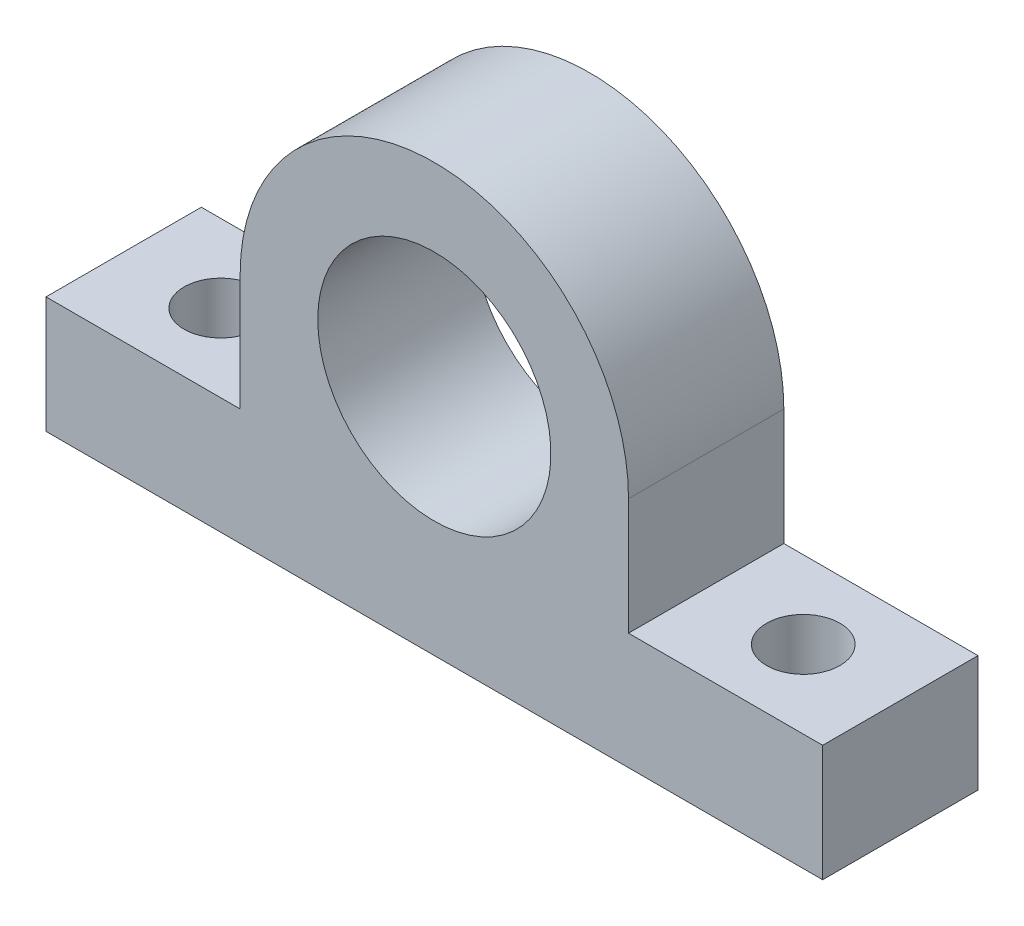
ISO-10303-21;
HEADER;
FILE_DESCRIPTION(('STEP AP214'),'2;1');
FILE_NAME('part.step','',(''),(''),'','','');
FILE_SCHEMA(('AUTOMOTIVE_DESIGN { 1 0 10303 214 1 1 1 1 }'));
ENDSEC;
DATA;
#1=APPLICATION_CONTEXT('core data for automotive mechanical design processes');
#2=APPLICATION_PROTOCOL_DEFINITION('international standard','automotive_design',2000,#1);
#3=PRODUCT_CONTEXT('',#1,'mechanical');
#4=PRODUCT('Part','Part','',(#3));
#5=PRODUCT_RELATED_PRODUCT_CATEGORY('part','',(#4));
#6=PRODUCT_DEFINITION_FORMATION('','',#4);
#7=PRODUCT_DEFINITION_CONTEXT('part definition',#1,'design');
#8=PRODUCT_DEFINITION('design','',#6,#7);
#9=PRODUCT_DEFINITION_SHAPE('','',#8);
#10=(LENGTH_UNIT() NAMED_UNIT(*) SI_UNIT(.MILLI.,.METRE.));
#11=(NAMED_UNIT(*) PLANE_ANGLE_UNIT() SI_UNIT($,.RADIAN.));
#12=(NAMED_UNIT(*) SI_UNIT($,.STERADIAN.) SOLID_ANGLE_UNIT());
#13=UNCERTAINTY_MEASURE_WITH_UNIT(LENGTH_MEASURE(1.E-05),#10,'distance_accuracy_value','');
#14=(GEOMETRIC_REPRESENTATION_CONTEXT(3) GLOBAL_UNCERTAINTY_ASSIGNED_CONTEXT((#13)) GLOBAL_UNIT_ASSIGNED_CONTEXT((#10,
#11,#12)) REPRESENTATION_CONTEXT('',''));
#15=CARTESIAN_POINT('',(0.,0.,0.));
#16=DIRECTION('',(0.,0.,1.));
#17=DIRECTION('',(1.,0.,0.));
#18=AXIS2_PLACEMENT_3D('',#15,#16,#17);
#19=CARTESIAN_POINT('',(0.,28.575,25.4));
#20=DIRECTION('',(0.,0.,-1.));
#21=DIRECTION('',(-1.,0.,0.));
#22=AXIS2_PLACEMENT_3D('',#19,#20,#21);
#23=CYLINDRICAL_SURFACE('',#22,31.75);
#24=CARTESIAN_POINT('',(0.,28.575,0.));
#25=DIRECTION('',(0.,0.,1.));
#26=DIRECTION('',(1.,0.,0.));
#27=AXIS2_PLACEMENT_3D('',#24,#25,#26);
#28=CIRCLE('',#27,31.75);
#29=CARTESIAN_POINT('',(-31.75,28.575,0.));
#30=VERTEX_POINT('',#29);
#31=CARTESIAN_POINT('',(31.75,28.575,0.));
#32=VERTEX_POINT('',#31);
#33=EDGE_CURVE('E152',#30,#32,#28,.F.);
#34=ORIENTED_EDGE('',*,*,#33,.F.);
#35=DIRECTION('',(0.,0.,-1.));
#36=VECTOR('',#35,1.);
#37=CARTESIAN_POINT('',(-31.75,28.575,25.4));
#38=LINE('',#37,#36);
#39=CARTESIAN_POINT('',(-31.75,28.575,25.4));
#40=VERTEX_POINT('',#39);
#41=EDGE_CURVE('E11',#40,#30,#38,.T.);
#42=ORIENTED_EDGE('',*,*,#41,.F.);
#43=CARTESIAN_POINT('',(0.,28.575,25.4));
#44=DIRECTION('',(0.,0.,1.));
#45=DIRECTION('',(1.,0.,0.));
#46=AXIS2_PLACEMENT_3D('',#43,#44,#45);
#47=CIRCLE('',#46,31.75);
#48=CARTESIAN_POINT('',(31.75,28.575,25.4));
#49=VERTEX_POINT('',#48);
#50=EDGE_CURVE('E139',#40,#49,#47,.F.);
#51=ORIENTED_EDGE('',*,*,#50,.T.);
#52=DIRECTION('',(0.,0.,-1.));
#53=VECTOR('',#52,1.);
#54=CARTESIAN_POINT('',(31.75,28.575,25.4));
#55=LINE('',#54,#53);
#56=EDGE_CURVE('E87',#49,#32,#55,.T.);
#57=ORIENTED_EDGE('',*,*,#56,.T.);
#58=EDGE_LOOP('',(#34,#42,#51,#57));
#59=FACE_BOUND('',#58,.T.);
#60=ADVANCED_FACE('F37',(#59),#23,.T.);
#61=CARTESIAN_POINT('',(-31.75,0.,25.4));
#62=DIRECTION('',(-1.,0.,0.));
#63=DIRECTION('',(0.,-1.,0.));
#64=AXIS2_PLACEMENT_3D('',#61,#62,#63);
#65=PLANE('',#64);
#66=DIRECTION('',(0.,1.,0.));
#67=VECTOR('',#66,1.);
#68=CARTESIAN_POINT('',(-31.75,0.,0.));
#69=LINE('',#68,#67);
#70=CARTESIAN_POINT('',(-31.75,9.525,0.));
#71=VERTEX_POINT('',#70);
#72=EDGE_CURVE('E181',#71,#30,#69,.T.);
#73=ORIENTED_EDGE('',*,*,#72,.F.);
#74=DIRECTION('',(0.,0.,-1.));
#75=VECTOR('',#74,1.);
#76=CARTESIAN_POINT('',(-31.75,9.525,25.4));
#77=LINE('',#76,#75);
#78=CARTESIAN_POINT('',(-31.75,9.525,25.4));
#79=VERTEX_POINT('',#78);
#80=EDGE_CURVE('E45',#79,#71,#77,.T.);
#81=ORIENTED_EDGE('',*,*,#80,.F.);
#82=DIRECTION('',(0.,1.,0.));
#83=VECTOR('',#82,1.);
#84=CARTESIAN_POINT('',(-31.75,0.,25.4));
#85=LINE('',#84,#83);
#86=EDGE_CURVE('E134',#79,#40,#85,.T.);
#87=ORIENTED_EDGE('',*,*,#86,.T.);
#88=ORIENTED_EDGE('',*,*,#41,.T.);
#89=EDGE_LOOP('',(#73,#81,#87,#88));
#90=FACE_BOUND('',#89,.T.);
#91=ADVANCED_FACE('F170',(#90),#65,.T.);
#92=CARTESIAN_POINT('',(0.,9.525,25.4));
#93=DIRECTION('',(0.,1.,0.));
#94=DIRECTION('',(0.,0.,1.));
#95=AXIS2_PLACEMENT_3D('',#92,#93,#94);
#96=PLANE('',#95);
#97=CARTESIAN_POINT('',(-47.625,9.525,12.7));
#98=DIRECTION('',(0.,1.,0.));
#99=DIRECTION('',(0.,0.,1.));
#100=AXIS2_PLACEMENT_3D('',#97,#98,#99);
#101=CIRCLE('',#100,6.);
#102=CARTESIAN_POINT('',(-47.625,9.525,18.7));
#103=VERTEX_POINT('',#102);
#104=EDGE_CURVE('E161',#103,#103,#101,.T.);
#105=ORIENTED_EDGE('',*,*,#104,.F.);
#106=EDGE_LOOP('',(#105));
#107=FACE_BOUND('',#106,.T.);
#108=DIRECTION('',(1.,0.,0.));
#109=VECTOR('',#108,1.);
#110=CARTESIAN_POINT('',(0.,9.525,0.));
#111=LINE('',#110,#109);
#112=CARTESIAN_POINT('',(-63.5,9.525,0.));
#113=VERTEX_POINT('',#112);
#114=EDGE_CURVE('E174',#113,#71,#111,.T.);
#115=ORIENTED_EDGE('',*,*,#114,.F.);
#116=DIRECTION('',(0.,0.,-1.));
#117=VECTOR('',#116,1.);
#118=CARTESIAN_POINT('',(-63.5,9.525,25.4));
#119=LINE('',#118,#117);
#120=CARTESIAN_POINT('',(-63.5,9.525,25.4));
#121=VERTEX_POINT('',#120);
#122=EDGE_CURVE('E176',#121,#113,#119,.T.);
#123=ORIENTED_EDGE('',*,*,#122,.F.);
#124=DIRECTION('',(1.,0.,0.));
#125=VECTOR('',#124,1.);
#126=CARTESIAN_POINT('',(0.,9.525,25.4));
#127=LINE('',#126,#125);
#128=EDGE_CURVE('E128',#121,#79,#127,.T.);
#129=ORIENTED_EDGE('',*,*,#128,.T.);
#130=ORIENTED_EDGE('',*,*,#80,.T.);
#131=EDGE_LOOP('',(#115,#123,#129,#130));
#132=FACE_BOUND('',#131,.T.);
#133=ADVANCED_FACE('F167',(#107,#132),#96,.T.);
#134=CARTESIAN_POINT('',(-63.5,0.,25.4));
#135=DIRECTION('',(-1.,0.,0.));
#136=DIRECTION('',(0.,0.,1.));
#137=AXIS2_PLACEMENT_3D('',#134,#135,#136);
#138=PLANE('',#137);
#139=DIRECTION('',(0.,1.,0.));
#140=VECTOR('',#139,1.);
#141=CARTESIAN_POINT('',(-63.5,0.,0.));
#142=LINE('',#141,#140);
#143=CARTESIAN_POINT('',(-63.5,-9.525,0.));
#144=VERTEX_POINT('',#143);
#145=EDGE_CURVE('E180',#144,#113,#142,.T.);
#146=ORIENTED_EDGE('',*,*,#145,.F.);
#147=DIRECTION('',(0.,0.,-1.));
#148=VECTOR('',#147,1.);
#149=CARTESIAN_POINT('',(-63.5,-9.525,25.4));
#150=LINE('',#149,#148);
#151=CARTESIAN_POINT('',(-63.5,-9.525,25.4));
#152=VERTEX_POINT('',#151);
#153=EDGE_CURVE('E199',#152,#144,#150,.T.);
#154=ORIENTED_EDGE('',*,*,#153,.F.);
#155=DIRECTION('',(0.,1.,0.));
#156=VECTOR('',#155,1.);
#157=CARTESIAN_POINT('',(-63.5,0.,25.4));
#158=LINE('',#157,#156);
#159=EDGE_CURVE('E133',#152,#121,#158,.T.);
#160=ORIENTED_EDGE('',*,*,#159,.T.);
#161=ORIENTED_EDGE('',*,*,#122,.T.);
#162=EDGE_LOOP('',(#146,#154,#160,#161));
#163=FACE_BOUND('',#162,.T.);
#164=ADVANCED_FACE('F169',(#163),#138,.T.);
#165=CARTESIAN_POINT('',(0.,-9.525,25.4));
#166=DIRECTION('',(0.,1.,0.));
#167=DIRECTION('',(0.,0.,1.));
#168=AXIS2_PLACEMENT_3D('',#165,#166,#167);
#169=PLANE('',#168);
#170=CARTESIAN_POINT('',(-47.625,-9.525,12.7));
#171=DIRECTION('',(0.,1.,0.));
#172=DIRECTION('',(0.,0.,1.));
#173=AXIS2_PLACEMENT_3D('',#170,#171,#172);
#174=CIRCLE('',#173,6.);
#175=CARTESIAN_POINT('',(-47.625,-9.525,18.7));
#176=VERTEX_POINT('',#175);
#177=EDGE_CURVE('E158',#176,#176,#174,.T.);
#178=ORIENTED_EDGE('',*,*,#177,.T.);
#179=EDGE_LOOP('',(#178));
#180=FACE_BOUND('',#179,.T.);
#181=CARTESIAN_POINT('',(47.625,-9.525,12.7));
#182=DIRECTION('',(0.,1.,0.));
#183=DIRECTION('',(0.,0.,1.));
#184=AXIS2_PLACEMENT_3D('',#181,#182,#183);
#185=CIRCLE('',#184,6.);
#186=CARTESIAN_POINT('',(47.625,-9.525,18.7));
#187=VERTEX_POINT('',#186);
#188=EDGE_CURVE('E149',#187,#187,#185,.T.);
#189=ORIENTED_EDGE('',*,*,#188,.T.);
#190=EDGE_LOOP('',(#189));
#191=FACE_BOUND('',#190,.T.);
#192=DIRECTION('',(1.,0.,0.));
#193=VECTOR('',#192,1.);
#194=CARTESIAN_POINT('',(0.,-9.525,0.));
#195=LINE('',#194,#193);
#196=CARTESIAN_POINT('',(63.5,-9.525,0.));
#197=VERTEX_POINT('',#196);
#198=EDGE_CURVE('E188',#144,#197,#195,.T.);
#199=ORIENTED_EDGE('',*,*,#198,.T.);
#200=DIRECTION('',(0.,0.,-1.));
#201=VECTOR('',#200,1.);
#202=CARTESIAN_POINT('',(63.5,-9.525,25.4));
#203=LINE('',#202,#201);
#204=CARTESIAN_POINT('',(63.5,-9.525,25.4));
#205=VERTEX_POINT('',#204);
#206=EDGE_CURVE('E124',#205,#197,#203,.T.);
#207=ORIENTED_EDGE('',*,*,#206,.F.);
#208=DIRECTION('',(1.,0.,0.));
#209=VECTOR('',#208,1.);
#210=CARTESIAN_POINT('',(0.,-9.525,25.4));
#211=LINE('',#210,#209);
#212=EDGE_CURVE('E111',#152,#205,#211,.T.);
#213=ORIENTED_EDGE('',*,*,#212,.F.);
#214=ORIENTED_EDGE('',*,*,#153,.T.);
#215=EDGE_LOOP('',(#199,#207,#213,#214));
#216=FACE_BOUND('',#215,.T.);
#217=ADVANCED_FACE('F210',(#180,#191,#216),#169,.F.);
#218=CARTESIAN_POINT('',(63.5,0.,25.4));
#219=DIRECTION('',(-1.,0.,0.));
#220=DIRECTION('',(0.,0.,1.));
#221=AXIS2_PLACEMENT_3D('',#218,#219,#220);
#222=PLANE('',#221);
#223=DIRECTION('',(0.,1.,0.));
#224=VECTOR('',#223,1.);
#225=CARTESIAN_POINT('',(63.5,0.,0.));
#226=LINE('',#225,#224);
#227=CARTESIAN_POINT('',(63.5,9.525,0.));
#228=VERTEX_POINT('',#227);
#229=EDGE_CURVE('E120',#197,#228,#226,.T.);
#230=ORIENTED_EDGE('',*,*,#229,.T.);
#231=DIRECTION('',(0.,0.,-1.));
#232=VECTOR('',#231,1.);
#233=CARTESIAN_POINT('',(63.5,9.525,25.4));
#234=LINE('',#233,#232);
#235=CARTESIAN_POINT('',(63.5,9.525,25.4));
#236=VERTEX_POINT('',#235);
#237=EDGE_CURVE('E117',#236,#228,#234,.T.);
#238=ORIENTED_EDGE('',*,*,#237,.F.);
#239=DIRECTION('',(0.,1.,0.));
#240=VECTOR('',#239,1.);
#241=CARTESIAN_POINT('',(63.5,0.,25.4));
#242=LINE('',#241,#240);
#243=EDGE_CURVE('E104',#205,#236,#242,.T.);
#244=ORIENTED_EDGE('',*,*,#243,.F.);
#245=ORIENTED_EDGE('',*,*,#206,.T.);
#246=EDGE_LOOP('',(#230,#238,#244,#245));
#247=FACE_BOUND('',#246,.T.);
#248=ADVANCED_FACE('F118',(#247),#222,.F.);
#249=CARTESIAN_POINT('',(47.625,9.525,12.7));
#250=DIRECTION('',(0.,1.,0.));
#251=DIRECTION('',(0.,0.,1.));
#252=AXIS2_PLACEMENT_3D('',#249,#250,#251);
#253=CIRCLE('',#252,6.);
#254=CARTESIAN_POINT('',(47.625,9.525,18.7));
#255=VERTEX_POINT('',#254);
#256=EDGE_CURVE('E155',#255,#255,#253,.T.);
#257=ORIENTED_EDGE('',*,*,#256,.F.);
#258=EDGE_LOOP('',(#257));
#259=FACE_BOUND('',#258,.T.);
#260=CARTESIAN_POINT('',(31.75,9.525,0.));
#261=VERTEX_POINT('',#260);
#262=EDGE_CURVE('E183',#261,#228,#111,.T.);
#263=ORIENTED_EDGE('',*,*,#262,.F.);
#264=DIRECTION('',(0.,0.,-1.));
#265=VECTOR('',#264,1.);
#266=CARTESIAN_POINT('',(31.75,9.525,25.4));
#267=LINE('',#266,#265);
#268=CARTESIAN_POINT('',(31.75,9.525,25.4));
#269=VERTEX_POINT('',#268);
#270=EDGE_CURVE('E80',#269,#261,#267,.T.);
#271=ORIENTED_EDGE('',*,*,#270,.F.);
#272=EDGE_CURVE('E108',#269,#236,#127,.T.);
#273=ORIENTED_EDGE('',*,*,#272,.T.);
#274=ORIENTED_EDGE('',*,*,#237,.T.);
#275=EDGE_LOOP('',(#263,#271,#273,#274));
#276=FACE_BOUND('',#275,.T.);
#277=ADVANCED_FACE('F126',(#259,#276),#96,.T.);
#278=CARTESIAN_POINT('',(31.75,0.,25.4));
#279=DIRECTION('',(-1.,0.,0.));
#280=DIRECTION('',(0.,-1.,0.));
#281=AXIS2_PLACEMENT_3D('',#278,#279,#280);
#282=PLANE('',#281);
#283=DIRECTION('',(0.,1.,0.));
#284=VECTOR('',#283,1.);
#285=CARTESIAN_POINT('',(31.75,0.,0.));
#286=LINE('',#285,#284);
#287=EDGE_CURVE('E142',#261,#32,#286,.T.);
#288=ORIENTED_EDGE('',*,*,#287,.T.);
#289=ORIENTED_EDGE('',*,*,#56,.F.);
#290=DIRECTION('',(0.,1.,0.));
#291=VECTOR('',#290,1.);
#292=CARTESIAN_POINT('',(31.75,0.,25.4));
#293=LINE('',#292,#291);
#294=EDGE_CURVE('E53',#269,#49,#293,.T.);
#295=ORIENTED_EDGE('',*,*,#294,.F.);
#296=ORIENTED_EDGE('',*,*,#270,.T.);
#297=EDGE_LOOP('',(#288,#289,#295,#296));
#298=FACE_BOUND('',#297,.T.);
#299=ADVANCED_FACE('F217',(#298),#282,.F.);
#300=CARTESIAN_POINT('',(0.,0.,25.4));
#301=DIRECTION('',(0.,0.,1.));
#302=DIRECTION('',(1.,0.,0.));
#303=AXIS2_PLACEMENT_3D('',#300,#301,#302);
#304=PLANE('',#303);
#305=CARTESIAN_POINT('',(0.,28.575,25.4));
#306=DIRECTION('',(0.,0.,-1.));
#307=DIRECTION('',(-1.,0.,0.));
#308=AXIS2_PLACEMENT_3D('',#305,#306,#307);
#309=CIRCLE('',#308,19.0627);
#310=CARTESIAN_POINT('',(-19.0627,28.575,25.4));
#311=VERTEX_POINT('',#310);
#312=EDGE_CURVE('E148',#311,#311,#309,.T.);
#313=ORIENTED_EDGE('',*,*,#312,.T.);
#314=EDGE_LOOP('',(#313));
#315=FACE_BOUND('',#314,.T.);
#316=ORIENTED_EDGE('',*,*,#50,.F.);
#317=ORIENTED_EDGE('',*,*,#86,.F.);
#318=ORIENTED_EDGE('',*,*,#128,.F.);
#319=ORIENTED_EDGE('',*,*,#159,.F.);
#320=ORIENTED_EDGE('',*,*,#212,.T.);
#321=ORIENTED_EDGE('',*,*,#243,.T.);
#322=ORIENTED_EDGE('',*,*,#272,.F.);
#323=ORIENTED_EDGE('',*,*,#294,.T.);
#324=EDGE_LOOP('',(#316,#317,#318,#319,#320,#321,#322,#323));
#325=FACE_BOUND('',#324,.T.);
#326=ADVANCED_FACE('F106',(#315,#325),#304,.T.);
#327=CARTESIAN_POINT('',(0.,0.,0.));
#328=DIRECTION('',(0.,0.,1.));
#329=DIRECTION('',(1.,0.,0.));
#330=AXIS2_PLACEMENT_3D('',#327,#328,#329);
#331=PLANE('',#330);
#332=CARTESIAN_POINT('',(0.,28.575,0.));
#333=DIRECTION('',(0.,0.,-1.));
#334=DIRECTION('',(-1.,0.,0.));
#335=AXIS2_PLACEMENT_3D('',#332,#333,#334);
#336=CIRCLE('',#335,19.0627);
#337=CARTESIAN_POINT('',(-19.0627,28.575,0.));
#338=VERTEX_POINT('',#337);
#339=EDGE_CURVE('E145',#338,#338,#336,.T.);
#340=ORIENTED_EDGE('',*,*,#339,.F.);
#341=EDGE_LOOP('',(#340));
#342=FACE_BOUND('',#341,.T.);
#343=ORIENTED_EDGE('',*,*,#33,.T.);
#344=ORIENTED_EDGE('',*,*,#287,.F.);
#345=ORIENTED_EDGE('',*,*,#262,.T.);
#346=ORIENTED_EDGE('',*,*,#229,.F.);
#347=ORIENTED_EDGE('',*,*,#198,.F.);
#348=ORIENTED_EDGE('',*,*,#145,.T.);
#349=ORIENTED_EDGE('',*,*,#114,.T.);
#350=ORIENTED_EDGE('',*,*,#72,.T.);
#351=EDGE_LOOP('',(#343,#344,#345,#346,#347,#348,#349,#350));
#352=FACE_BOUND('',#351,.T.);
#353=ADVANCED_FACE('F187',(#342,#352),#331,.F.);
#354=CARTESIAN_POINT('',(0.,28.575,25.4));
#355=DIRECTION('',(0.,0.,-1.));
#356=DIRECTION('',(-1.,0.,0.));
#357=AXIS2_PLACEMENT_3D('',#354,#355,#356);
#358=CYLINDRICAL_SURFACE('',#357,19.0627);
#359=ORIENTED_EDGE('',*,*,#312,.F.);
#360=EDGE_LOOP('',(#359));
#361=FACE_BOUND('',#360,.T.);
#362=ORIENTED_EDGE('',*,*,#339,.T.);
#363=EDGE_LOOP('',(#362));
#364=FACE_BOUND('',#363,.T.);
#365=ADVANCED_FACE('F223',(#361,#364),#358,.F.);
#366=CARTESIAN_POINT('',(47.625,9.525,12.7));
#367=DIRECTION('',(0.,1.,0.));
#368=DIRECTION('',(0.,0.,1.));
#369=AXIS2_PLACEMENT_3D('',#366,#367,#368);
#370=CYLINDRICAL_SURFACE('',#369,6.);
#371=ORIENTED_EDGE('',*,*,#188,.F.);
#372=EDGE_LOOP('',(#371));
#373=FACE_BOUND('',#372,.T.);
#374=ORIENTED_EDGE('',*,*,#256,.T.);
#375=EDGE_LOOP('',(#374));
#376=FACE_BOUND('',#375,.T.);
#377=ADVANCED_FACE('F230',(#373,#376),#370,.F.);
#378=CARTESIAN_POINT('',(-47.625,9.525,12.7));
#379=DIRECTION('',(0.,1.,0.));
#380=DIRECTION('',(0.,0.,1.));
#381=AXIS2_PLACEMENT_3D('',#378,#379,#380);
#382=CYLINDRICAL_SURFACE('',#381,6.);
#383=ORIENTED_EDGE('',*,*,#177,.F.);
#384=EDGE_LOOP('',(#383));
#385=FACE_BOUND('',#384,.T.);
#386=ORIENTED_EDGE('',*,*,#104,.T.);
#387=EDGE_LOOP('',(#386));
#388=FACE_BOUND('',#387,.T.);
#389=ADVANCED_FACE('F165',(#385,#388),#382,.F.);
#390=CLOSED_SHELL('',(#60,#91,#133,#164,#217,#248,#277,#299,#326,#353,#365,#377,#389));
#391=MANIFOLD_SOLID_BREP('B2',#390);
#392=ADVANCED_BREP_SHAPE_REPRESENTATION('',(#18,#391),#14);
#393=SHAPE_DEFINITION_REPRESENTATION(#9,#392);
ENDSEC;
END-ISO-10303-21;
